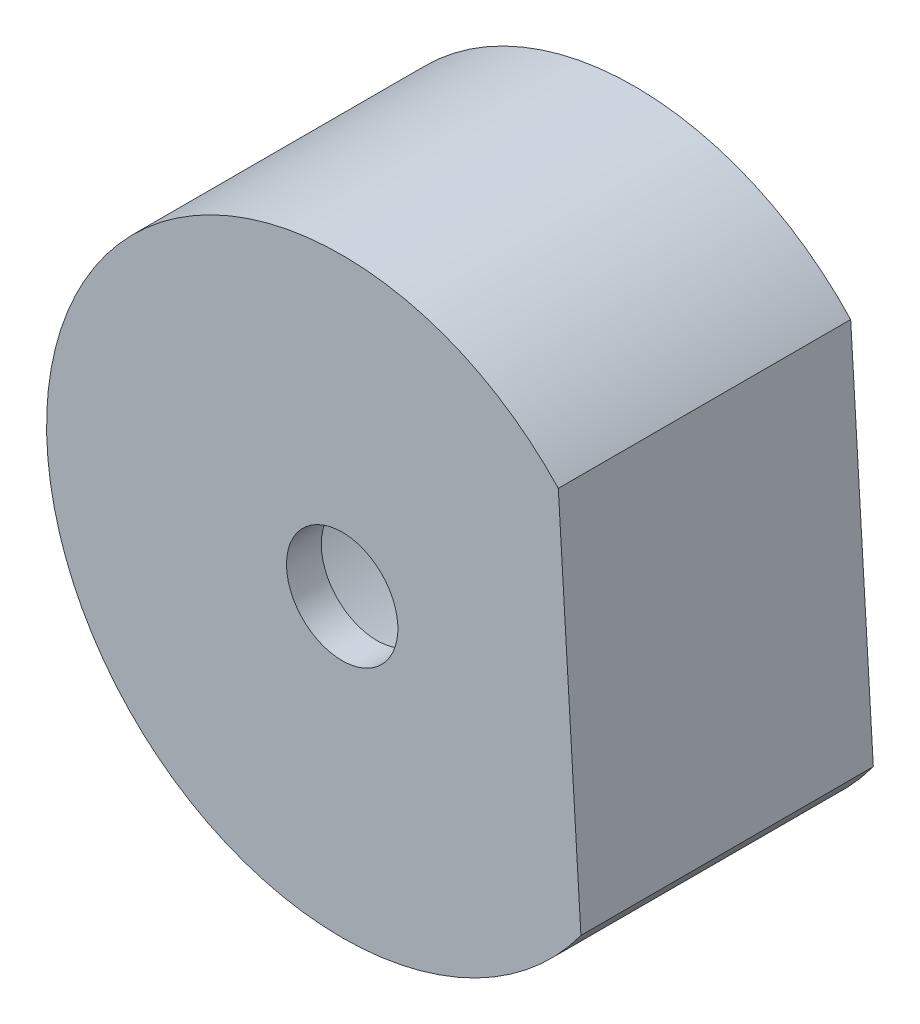
ISO-10303-21;
HEADER;
FILE_DESCRIPTION(('STEP AP214'),'2;1');
FILE_NAME('part.step','',(''),(''),'','','');
FILE_SCHEMA(('AUTOMOTIVE_DESIGN { 1 0 10303 214 1 1 1 1 }'));
ENDSEC;
DATA;
#1=APPLICATION_CONTEXT('core data for automotive mechanical design processes');
#2=APPLICATION_PROTOCOL_DEFINITION('international standard','automotive_design',2000,#1);
#3=PRODUCT_CONTEXT('',#1,'mechanical');
#4=PRODUCT('Part','Part','',(#3));
#5=PRODUCT_RELATED_PRODUCT_CATEGORY('part','',(#4));
#6=PRODUCT_DEFINITION_FORMATION('','',#4);
#7=PRODUCT_DEFINITION_CONTEXT('part definition',#1,'design');
#8=PRODUCT_DEFINITION('design','',#6,#7);
#9=PRODUCT_DEFINITION_SHAPE('','',#8);
#10=(LENGTH_UNIT() NAMED_UNIT(*) SI_UNIT(.MILLI.,.METRE.));
#11=(NAMED_UNIT(*) PLANE_ANGLE_UNIT() SI_UNIT($,.RADIAN.));
#12=(NAMED_UNIT(*) SI_UNIT($,.STERADIAN.) SOLID_ANGLE_UNIT());
#13=UNCERTAINTY_MEASURE_WITH_UNIT(LENGTH_MEASURE(1.E-05),#10,'distance_accuracy_value','');
#14=(GEOMETRIC_REPRESENTATION_CONTEXT(3) GLOBAL_UNCERTAINTY_ASSIGNED_CONTEXT((#13)) GLOBAL_UNIT_ASSIGNED_CONTEXT((#10,
#11,#12)) REPRESENTATION_CONTEXT('',''));
#15=CARTESIAN_POINT('',(0.,0.,0.));
#16=DIRECTION('',(0.,0.,1.));
#17=DIRECTION('',(1.,0.,0.));
#18=AXIS2_PLACEMENT_3D('',#15,#16,#17);
#19=CARTESIAN_POINT('',(78.5761930997044,-343.706992300082,7.4));
#20=DIRECTION('',(0.,0.,1.));
#21=DIRECTION('',(1.,0.,0.));
#22=AXIS2_PLACEMENT_3D('',#19,#20,#21);
#23=PLANE('',#22);
#24=CARTESIAN_POINT('',(78.5761930997044,-343.706992300082,7.4));
#25=DIRECTION('',(0.,0.,1.));
#26=DIRECTION('',(1.,0.,0.));
#27=AXIS2_PLACEMENT_3D('',#24,#25,#26);
#28=CIRCLE('',#27,5.99200658305286);
#29=CARTESIAN_POINT('',(84.5681996827572,-343.706992300082,7.4));
#30=VERTEX_POINT('',#29);
#31=EDGE_CURVE('E71',#30,#30,#28,.T.);
#32=ORIENTED_EDGE('',*,*,#31,.F.);
#33=EDGE_LOOP('',(#32));
#34=FACE_BOUND('',#33,.T.);
#35=CARTESIAN_POINT('',(78.5761930997044,-343.706992300082,7.4));
#36=DIRECTION('',(0.,0.,-1.));
#37=DIRECTION('',(-1.,0.,0.));
#38=AXIS2_PLACEMENT_3D('',#35,#36,#37);
#39=CIRCLE('',#38,1.59999999999999);
#40=CARTESIAN_POINT('',(76.9761930997044,-343.706992300082,7.4));
#41=VERTEX_POINT('',#40);
#42=EDGE_CURVE('E81',#41,#41,#39,.T.);
#43=ORIENTED_EDGE('',*,*,#42,.F.);
#44=EDGE_LOOP('',(#43));
#45=FACE_BOUND('',#44,.T.);
#46=ADVANCED_FACE('F32',(#34,#45),#23,.F.);
#47=CARTESIAN_POINT('',(78.5761930997044,-343.706992300082,8.4));
#48=DIRECTION('',(0.,0.,1.));
#49=DIRECTION('',(1.,0.,0.));
#50=AXIS2_PLACEMENT_3D('',#47,#48,#49);
#51=PLANE('',#50);
#52=DIRECTION('',(0.0600998632276327,-0.998192369455918,0.));
#53=VECTOR('',#52,1.);
#54=CARTESIAN_POINT('',(85.1104583748226,-343.313572693456,8.4));
#55=LINE('',#54,#53);
#56=CARTESIAN_POINT('',(84.7853476987143,-337.913843331498,8.4));
#57=VERTEX_POINT('',#56);
#58=CARTESIAN_POINT('',(85.4355690509309,-348.713302055415,8.4));
#59=VERTEX_POINT('',#58);
#60=EDGE_CURVE('E11',#57,#59,#55,.T.);
#61=ORIENTED_EDGE('',*,*,#60,.F.);
#62=CARTESIAN_POINT('',(78.5761930997044,-343.706992300082,8.4));
#63=DIRECTION('',(0.,0.,1.));
#64=DIRECTION('',(1.,0.,0.));
#65=AXIS2_PLACEMENT_3D('',#62,#63,#64);
#66=CIRCLE('',#65,8.49200658305284);
#67=EDGE_CURVE('E76',#57,#59,#66,.T.);
#68=ORIENTED_EDGE('',*,*,#67,.T.);
#69=EDGE_LOOP('',(#61,#68));
#70=FACE_BOUND('',#69,.T.);
#71=CARTESIAN_POINT('',(78.5761930997044,-343.706992300082,8.4));
#72=DIRECTION('',(0.,0.,-1.));
#73=DIRECTION('',(-1.,0.,0.));
#74=AXIS2_PLACEMENT_3D('',#71,#72,#73);
#75=CIRCLE('',#74,1.6);
#76=CARTESIAN_POINT('',(76.9761930997044,-343.706992300082,8.4));
#77=VERTEX_POINT('',#76);
#78=EDGE_CURVE('E67',#77,#77,#75,.T.);
#79=ORIENTED_EDGE('',*,*,#78,.T.);
#80=EDGE_LOOP('',(#79));
#81=FACE_BOUND('',#80,.T.);
#82=ADVANCED_FACE('F88',(#70,#81),#51,.T.);
#83=CARTESIAN_POINT('',(78.5761930997044,-343.706992300082,0.));
#84=DIRECTION('',(0.,0.,1.));
#85=DIRECTION('',(1.,0.,0.));
#86=AXIS2_PLACEMENT_3D('',#83,#84,#85);
#87=PLANE('',#86);
#88=CARTESIAN_POINT('',(78.5761930997044,-343.706992300082,0.));
#89=DIRECTION('',(0.,0.,1.));
#90=DIRECTION('',(1.,0.,0.));
#91=AXIS2_PLACEMENT_3D('',#88,#89,#90);
#92=CIRCLE('',#91,8.49200658305285);
#93=CARTESIAN_POINT('',(84.7853476987143,-337.913843331498,0.));
#94=VERTEX_POINT('',#93);
#95=CARTESIAN_POINT('',(85.4355690509309,-348.713302055415,0.));
#96=VERTEX_POINT('',#95);
#97=EDGE_CURVE('E40',#94,#96,#92,.T.);
#98=ORIENTED_EDGE('',*,*,#97,.F.);
#99=DIRECTION('',(-0.0600998632276327,0.998192369455918,0.));
#100=VECTOR('',#99,1.);
#101=CARTESIAN_POINT('',(84.7853476987143,-337.913843331498,0.));
#102=LINE('',#101,#100);
#103=EDGE_CURVE('E57',#96,#94,#102,.T.);
#104=ORIENTED_EDGE('',*,*,#103,.F.);
#105=EDGE_LOOP('',(#98,#104));
#106=FACE_BOUND('',#105,.T.);
#107=CARTESIAN_POINT('',(78.5761930997044,-343.706992300082,0.));
#108=DIRECTION('',(0.,0.,1.));
#109=DIRECTION('',(1.,0.,0.));
#110=AXIS2_PLACEMENT_3D('',#107,#108,#109);
#111=CIRCLE('',#110,5.99200658305286);
#112=CARTESIAN_POINT('',(84.5681996827572,-343.706992300082,0.));
#113=VERTEX_POINT('',#112);
#114=EDGE_CURVE('E69',#113,#113,#111,.T.);
#115=ORIENTED_EDGE('',*,*,#114,.T.);
#116=EDGE_LOOP('',(#115));
#117=FACE_BOUND('',#116,.T.);
#118=ADVANCED_FACE('F65',(#106,#117),#87,.F.);
#119=CARTESIAN_POINT('',(78.5761930997044,-343.706992300082,7.4));
#120=DIRECTION('',(0.,0.,-1.));
#121=DIRECTION('',(-1.,0.,0.));
#122=AXIS2_PLACEMENT_3D('',#119,#120,#121);
#123=CYLINDRICAL_SURFACE('',#122,8.49200658305285);
#124=ORIENTED_EDGE('',*,*,#67,.F.);
#125=DIRECTION('',(0.,0.,-1.));
#126=VECTOR('',#125,1.);
#127=CARTESIAN_POINT('',(84.7853476987143,-337.913843331498,18.3));
#128=LINE('',#127,#126);
#129=EDGE_CURVE('E46',#57,#94,#128,.T.);
#130=ORIENTED_EDGE('',*,*,#129,.T.);
#131=ORIENTED_EDGE('',*,*,#97,.T.);
#132=DIRECTION('',(0.,0.,-1.));
#133=VECTOR('',#132,1.);
#134=CARTESIAN_POINT('',(85.4355690509309,-348.713302055415,18.3));
#135=LINE('',#134,#133);
#136=EDGE_CURVE('E54',#59,#96,#135,.T.);
#137=ORIENTED_EDGE('',*,*,#136,.F.);
#138=EDGE_LOOP('',(#124,#130,#131,#137));
#139=FACE_BOUND('',#138,.T.);
#140=ADVANCED_FACE('F34',(#139),#123,.T.);
#141=CARTESIAN_POINT('',(78.5761930997044,-343.706992300082,7.4));
#142=DIRECTION('',(0.,0.,-1.));
#143=DIRECTION('',(-1.,0.,0.));
#144=AXIS2_PLACEMENT_3D('',#141,#142,#143);
#145=CYLINDRICAL_SURFACE('',#144,5.99200658305286);
#146=ORIENTED_EDGE('',*,*,#31,.T.);
#147=EDGE_LOOP('',(#146));
#148=FACE_BOUND('',#147,.T.);
#149=ORIENTED_EDGE('',*,*,#114,.F.);
#150=EDGE_LOOP('',(#149));
#151=FACE_BOUND('',#150,.T.);
#152=ADVANCED_FACE('F99',(#148,#151),#145,.F.);
#153=CARTESIAN_POINT('',(84.7853476987143,-337.913843331498,18.3));
#154=DIRECTION('',(-0.998192369455918,-0.0600998632276327,0.));
#155=DIRECTION('',(0.0600998632276327,-0.998192369455918,0.));
#156=AXIS2_PLACEMENT_3D('',#153,#154,#155);
#157=PLANE('',#156);
#158=ORIENTED_EDGE('',*,*,#60,.T.);
#159=ORIENTED_EDGE('',*,*,#136,.T.);
#160=ORIENTED_EDGE('',*,*,#103,.T.);
#161=ORIENTED_EDGE('',*,*,#129,.F.);
#162=EDGE_LOOP('',(#158,#159,#160,#161));
#163=FACE_BOUND('',#162,.T.);
#164=ADVANCED_FACE('F56',(#163),#157,.F.);
#165=CARTESIAN_POINT('',(78.5761930997044,-343.706992300082,7.4));
#166=DIRECTION('',(0.,0.,-1.));
#167=DIRECTION('',(-1.,0.,0.));
#168=AXIS2_PLACEMENT_3D('',#165,#166,#167);
#169=CYLINDRICAL_SURFACE('',#168,1.6);
#170=ORIENTED_EDGE('',*,*,#78,.F.);
#171=EDGE_LOOP('',(#170));
#172=FACE_BOUND('',#171,.T.);
#173=ORIENTED_EDGE('',*,*,#42,.T.);
#174=EDGE_LOOP('',(#173));
#175=FACE_BOUND('',#174,.T.);
#176=ADVANCED_FACE('F85',(#172,#175),#169,.F.);
#177=CLOSED_SHELL('',(#46,#82,#118,#140,#152,#164,#176));
#178=MANIFOLD_SOLID_BREP('B2',#177);
#179=ADVANCED_BREP_SHAPE_REPRESENTATION('',(#18,#178),#14);
#180=SHAPE_DEFINITION_REPRESENTATION(#9,#179);
ENDSEC;
END-ISO-10303-21;
